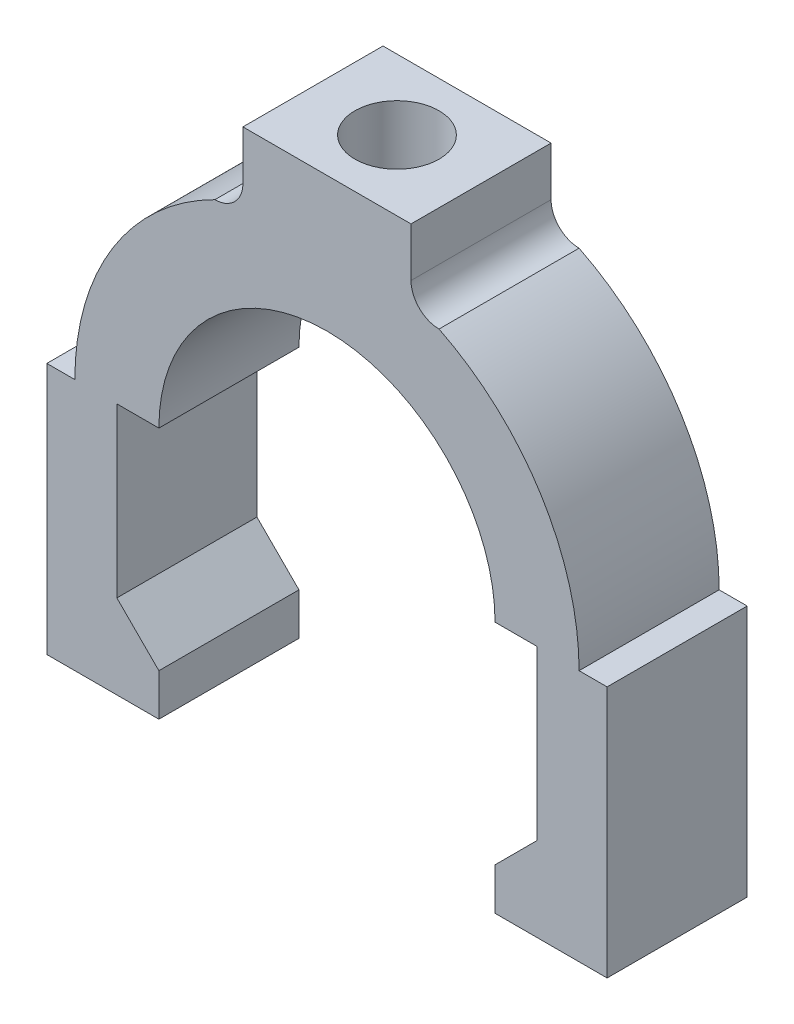
ISO-10303-21;
HEADER;
FILE_DESCRIPTION(('STEP AP214'),'2;1');
FILE_NAME('part.step','',(''),(''),'','','');
FILE_SCHEMA(('AUTOMOTIVE_DESIGN { 1 0 10303 214 1 1 1 1 }'));
ENDSEC;
DATA;
#1=APPLICATION_CONTEXT('core data for automotive mechanical design processes');
#2=APPLICATION_PROTOCOL_DEFINITION('international standard','automotive_design',2000,#1);
#3=PRODUCT_CONTEXT('',#1,'mechanical');
#4=PRODUCT('Part','Part','',(#3));
#5=PRODUCT_RELATED_PRODUCT_CATEGORY('part','',(#4));
#6=PRODUCT_DEFINITION_FORMATION('','',#4);
#7=PRODUCT_DEFINITION_CONTEXT('part definition',#1,'design');
#8=PRODUCT_DEFINITION('design','',#6,#7);
#9=PRODUCT_DEFINITION_SHAPE('','',#8);
#10=(LENGTH_UNIT() NAMED_UNIT(*) SI_UNIT(.MILLI.,.METRE.));
#11=(NAMED_UNIT(*) PLANE_ANGLE_UNIT() SI_UNIT($,.RADIAN.));
#12=(NAMED_UNIT(*) SI_UNIT($,.STERADIAN.) SOLID_ANGLE_UNIT());
#13=UNCERTAINTY_MEASURE_WITH_UNIT(LENGTH_MEASURE(1.E-05),#10,'distance_accuracy_value','');
#14=(GEOMETRIC_REPRESENTATION_CONTEXT(3) GLOBAL_UNCERTAINTY_ASSIGNED_CONTEXT((#13)) GLOBAL_UNIT_ASSIGNED_CONTEXT((#10,
#11,#12)) REPRESENTATION_CONTEXT('',''));
#15=CARTESIAN_POINT('',(0.,0.,0.));
#16=DIRECTION('',(0.,0.,1.));
#17=DIRECTION('',(1.,0.,0.));
#18=AXIS2_PLACEMENT_3D('',#15,#16,#17);
#19=CARTESIAN_POINT('',(12.,-43.2490309931942,20.));
#20=DIRECTION('',(0.,0.,-1.));
#21=DIRECTION('',(-1.,0.,0.));
#22=AXIS2_PLACEMENT_3D('',#19,#20,#21);
#23=CYLINDRICAL_SURFACE('',#22,24.);
#24=CARTESIAN_POINT('',(12.,-43.2490309931942,0.));
#25=DIRECTION('',(0.,0.,1.));
#26=DIRECTION('',(1.,0.,0.));
#27=AXIS2_PLACEMENT_3D('',#24,#25,#26);
#28=CIRCLE('',#27,24.);
#29=CARTESIAN_POINT('',(36.,-43.2490309931942,0.));
#30=VERTEX_POINT('',#29);
#31=CARTESIAN_POINT('',(-12.,-43.2490309931942,0.));
#32=VERTEX_POINT('',#31);
#33=EDGE_CURVE('E287',#30,#32,#28,.T.);
#34=ORIENTED_EDGE('',*,*,#33,.F.);
#35=DIRECTION('',(0.,0.,-1.));
#36=VECTOR('',#35,1.);
#37=CARTESIAN_POINT('',(36.,-43.2490309931942,20.));
#38=LINE('',#37,#36);
#39=CARTESIAN_POINT('',(36.,-43.2490309931942,20.));
#40=VERTEX_POINT('',#39);
#41=EDGE_CURVE('E356',#40,#30,#38,.T.);
#42=ORIENTED_EDGE('',*,*,#41,.F.);
#43=CARTESIAN_POINT('',(12.,-43.2490309931942,20.));
#44=DIRECTION('',(0.,0.,1.));
#45=DIRECTION('',(1.,0.,0.));
#46=AXIS2_PLACEMENT_3D('',#43,#44,#45);
#47=CIRCLE('',#46,24.);
#48=CARTESIAN_POINT('',(-12.,-43.2490309931942,20.));
#49=VERTEX_POINT('',#48);
#50=EDGE_CURVE('E526',#40,#49,#47,.T.);
#51=ORIENTED_EDGE('',*,*,#50,.T.);
#52=DIRECTION('',(0.,0.,-1.));
#53=VECTOR('',#52,1.);
#54=CARTESIAN_POINT('',(-12.,-43.2490309931942,20.));
#55=LINE('',#54,#53);
#56=EDGE_CURVE('E353',#49,#32,#55,.T.);
#57=ORIENTED_EDGE('',*,*,#56,.T.);
#58=EDGE_LOOP('',(#34,#42,#51,#57));
#59=FACE_BOUND('',#58,.T.);
#60=CARTESIAN_POINT('',(17.9567237536666,-20.,10.7193344997313));
#61=CARTESIAN_POINT('',(17.9366722157145,-19.9948750872522,10.8855477551348));
#62=CARTESIAN_POINT('',(17.9096326972914,-19.9879625135984,11.0508504700604));
#63=CARTESIAN_POINT('',(17.8419036192748,-19.9708537309565,11.378428070861));
#64=CARTESIAN_POINT('',(17.801216921579,-19.9606582104405,11.5407035840335));
#65=CARTESIAN_POINT('',(17.7065969108849,-19.9372941090037,11.860799145743));
#66=CARTESIAN_POINT('',(17.6526878403376,-19.9241309725638,12.0186267653695));
#67=CARTESIAN_POINT('',(17.5320213657373,-19.8952176640746,12.3290484726601));
#68=CARTESIAN_POINT('',(17.465263592785,-19.8794674177487,12.4816424099115));
#69=CARTESIAN_POINT('',(17.3194443736893,-19.8458453006553,12.780493476057));
#70=CARTESIAN_POINT('',(17.2403889468592,-19.8279744688572,12.9267536605854));
#71=CARTESIAN_POINT('',(17.0704935694356,-19.7906069131501,13.2121144548874));
#72=CARTESIAN_POINT('',(16.9796492648153,-19.7711095894783,13.3512123927593));
#73=CARTESIAN_POINT('',(16.786839515547,-19.7310409055465,13.6212833514732));
#74=CARTESIAN_POINT('',(16.6848753569715,-19.7104696696336,13.7522573091554));
#75=CARTESIAN_POINT('',(16.4704573315702,-19.668807491987,14.0053121147333));
#76=CARTESIAN_POINT('',(16.3579995469474,-19.6477163583294,14.127389610594));
#77=CARTESIAN_POINT('',(16.1211065232701,-19.6051896298134,14.3640631681794));
#78=CARTESIAN_POINT('',(15.9964832053519,-19.5837551701824,14.4784712688746));
#79=CARTESIAN_POINT('',(15.7379092618935,-19.541538550425,14.696449611805));
#80=CARTESIAN_POINT('',(15.6039551670349,-19.5207566371365,14.8000157866453));
#81=CARTESIAN_POINT('',(15.3276899741616,-19.4804391827157,14.9955084790985));
#82=CARTESIAN_POINT('',(15.1853814397207,-19.4609032630477,15.0874385402272));
#83=CARTESIAN_POINT('',(14.8932702157816,-19.4236102938033,15.2590581641824));
#84=CARTESIAN_POINT('',(14.7434648206088,-19.4058538935132,15.3387432648532));
#85=CARTESIAN_POINT('',(14.4374170908932,-19.3726265500895,15.4852330201922));
#86=CARTESIAN_POINT('',(14.281174079293,-19.3571558481361,15.5520363158363));
#87=CARTESIAN_POINT('',(13.9633667527338,-19.3289424353641,15.6722174734043));
#88=CARTESIAN_POINT('',(13.8018024787952,-19.3161997035219,15.7255954387936));
#89=CARTESIAN_POINT('',(13.4745549798837,-19.2938107268193,15.8184715137504));
#90=CARTESIAN_POINT('',(13.3088725685056,-19.2841638754825,15.8579723419632));
#91=CARTESIAN_POINT('',(12.9745898136563,-19.268243463698,15.9227661556549));
#92=CARTESIAN_POINT('',(12.8059894760555,-19.2619698964647,15.9480591697136));
#93=CARTESIAN_POINT('',(12.4716695887984,-19.2530991910502,15.9837306297597));
#94=CARTESIAN_POINT('',(12.3059928834466,-19.2504086009209,15.9944883041794));
#95=CARTESIAN_POINT('',(11.9742430095348,-19.2484714357093,16.0022390765058));
#96=CARTESIAN_POINT('',(11.8081697310235,-19.2492259635628,15.9992277663461));
#97=CARTESIAN_POINT('',(11.4769354104411,-19.254160012427,15.9794585281744));
#98=CARTESIAN_POINT('',(11.3117741608439,-19.2583387189828,15.9627038690731));
#99=CARTESIAN_POINT('',(10.9835207946194,-19.2700038528487,15.9155948605909));
#100=CARTESIAN_POINT('',(10.8204286921652,-19.2774903028034,15.8852404181065));
#101=CARTESIAN_POINT('',(10.4994258416553,-19.2954548451261,15.81163199394));
#102=CARTESIAN_POINT('',(10.3414763593196,-19.305895850904,15.7685376454492));
#103=CARTESIAN_POINT('',(10.0298643566259,-19.3295206611495,15.6696803889725));
#104=CARTESIAN_POINT('',(9.87620042098209,-19.3427035476601,15.6139217203138));
#105=CARTESIAN_POINT('',(9.57405947353882,-19.3714713531541,15.490125513837));
#106=CARTESIAN_POINT('',(9.42558469715659,-19.3870572920673,15.4220827601666));
#107=CARTESIAN_POINT('',(9.13489758089681,-19.4202126380649,15.2742552559381));
#108=CARTESIAN_POINT('',(8.99268319529718,-19.4377813904317,15.1944743786372));
#109=CARTESIAN_POINT('',(8.71255027578381,-19.4748214469002,15.0219792714636));
#110=CARTESIAN_POINT('',(8.57477688327061,-19.4943240536716,14.9290360169433));
#111=CARTESIAN_POINT('',(8.30755584726624,-19.5343919013956,14.7321653909352));
#112=CARTESIAN_POINT('',(8.17810541276141,-19.5549567819102,14.6282417328352));
#113=CARTESIAN_POINT('',(7.92822907465294,-19.59661594922,14.4100127881096));
#114=CARTESIAN_POINT('',(7.80780849351543,-19.6177105386147,14.2957014651223));
#115=CARTESIAN_POINT('',(7.57688789645956,-19.6598416696349,14.0575340583024));
#116=CARTESIAN_POINT('',(7.46638440990357,-19.6808782290511,13.9336813420472));
#117=CARTESIAN_POINT('',(7.25346159838048,-19.7228237067665,13.6741276318547));
#118=CARTESIAN_POINT('',(7.1512974237139,-19.7437176582567,13.5382147355156));
#119=CARTESIAN_POINT('',(6.95882715695373,-19.7842435810507,13.2581345927572));
#120=CARTESIAN_POINT('',(6.868516759266,-19.8038760092421,13.1139703709059));
#121=CARTESIAN_POINT('',(6.70040932303223,-19.8413024274724,12.818372921407));
#122=CARTESIAN_POINT('',(6.6226064956427,-19.8590972666255,12.6669430988598));
#123=CARTESIAN_POINT('',(6.48008816072602,-19.8923206022131,12.3578689611957));
#124=CARTESIAN_POINT('',(6.41536926293459,-19.9077497113966,12.2002262686205));
#125=CARTESIAN_POINT('',(6.28044770478669,-19.9403834778416,11.8269998049434));
#126=CARTESIAN_POINT('',(6.21543480909445,-19.9565047830136,11.6094028639243));
#127=CARTESIAN_POINT('',(6.13669844539461,-19.9762484898549,11.2785043129763));
#128=CARTESIAN_POINT('',(6.11358612714192,-19.9820893202612,11.1674760542472));
#129=CARTESIAN_POINT('',(6.07367825610507,-19.9922230617034,10.9442240308355));
#130=CARTESIAN_POINT('',(6.05688249939753,-19.9965160227104,10.8320003048677));
#131=CARTESIAN_POINT('',(6.04327624633337,-20.,10.7193344997313));
#132=B_SPLINE_CURVE_WITH_KNOTS('',3,(#60,#61,#62,#63,#64,#65,#66,#67,#68,#69,#70,#71,#72,#73,
#74,#75,#76,#77,#78,#79,#80,#81,#82,#83,#84,#85,#86,#87,#88,#89,#90,#91,#92,#93,#94,#95,#96,#97,
#98,#99,#100,#101,#102,#103,#104,#105,#106,#107,#108,#109,#110,#111,#112,#113,#114,#115,#116,
#117,#118,#119,#120,#121,#122,#123,#124,#125,#126,#127,#128,#129,#130,#131),.UNSPECIFIED.,.F.,
.F.,(4,2,2,2,2,2,2,2,2,2,2,2,2,2,2,2,2,2,2,2,2,2,2,2,2,2,2,2,2,2,2,2,2,2,2,4),(0.,
0.502316897238534,1.00452852131734,1.50582616371642,2.00713820103227,2.50820562957609,
3.00945864858852,3.5106537562766,4.01203673969841,4.52301803145163,5.0341903381887,
5.54520660248876,6.05640864559896,6.56766459080687,7.07891659578509,7.59006838637142,
8.10121914874435,8.59875833552551,9.09645681795312,9.59403695511616,10.0916204987423,
10.5832159652996,11.0746471142752,11.5662874189768,12.0577658582569,12.559188601844,
13.0604423121863,13.5619891911827,14.0633598561406,14.5766689157384,15.089791009372,
15.6026749281427,16.1154257793233,16.7967151912876,17.1372289721767,17.4777317590017),.UNSPECIFIED.);
#133=CARTESIAN_POINT('',(17.9567237536666,-20.,10.7193344997313));
#134=VERTEX_POINT('',#133);
#135=CARTESIAN_POINT('',(6.04327624633337,-20.,10.7193344997313));
#136=VERTEX_POINT('',#135);
#137=EDGE_CURVE('E391',#134,#136,#132,.T.);
#138=ORIENTED_EDGE('',*,*,#137,.F.);
#139=DIRECTION('',(0.,0.,-1.));
#140=VECTOR('',#139,1.);
#141=CARTESIAN_POINT('',(17.9567237536666,-20.,20.));
#142=LINE('',#141,#140);
#143=CARTESIAN_POINT('',(17.9567237536666,-20.,9.28066550026872));
#144=VERTEX_POINT('',#143);
#145=EDGE_CURVE('E11',#134,#144,#142,.T.);
#146=ORIENTED_EDGE('',*,*,#145,.T.);
#147=CARTESIAN_POINT('',(6.04327624633337,-20.,9.28066550026867));
#148=CARTESIAN_POINT('',(6.06332778428551,-19.9948750872522,9.11445224486512));
#149=CARTESIAN_POINT('',(6.0903673027086,-19.9879625135984,8.94914952993954));
#150=CARTESIAN_POINT('',(6.15809638072517,-19.9708537309565,8.62157192913892));
#151=CARTESIAN_POINT('',(6.19878307842105,-19.9606582104405,8.45929641596642));
#152=CARTESIAN_POINT('',(6.29340308911513,-19.9372941090037,8.13920085425699));
#153=CARTESIAN_POINT('',(6.34731215966243,-19.9241309725638,7.98137323463041));
#154=CARTESIAN_POINT('',(6.46797863426269,-19.8952176640746,7.67095152733982));
#155=CARTESIAN_POINT('',(6.53473640721506,-19.8794674177487,7.51835759008845));
#156=CARTESIAN_POINT('',(6.68055562631074,-19.8458453006553,7.21950652394298));
#157=CARTESIAN_POINT('',(6.75961105314081,-19.8279744688572,7.07324633941457));
#158=CARTESIAN_POINT('',(6.92950643056445,-19.7906069131501,6.78788554511257));
#159=CARTESIAN_POINT('',(7.02035073518468,-19.7711095894783,6.64878760724061));
#160=CARTESIAN_POINT('',(7.21316048445302,-19.7310409055465,6.37871664852677));
#161=CARTESIAN_POINT('',(7.31512464302855,-19.7104696696336,6.24774269084454));
#162=CARTESIAN_POINT('',(7.52954266842985,-19.668807491987,5.99468788526667));
#163=CARTESIAN_POINT('',(7.6420004530526,-19.6477163583294,5.872610389406));
#164=CARTESIAN_POINT('',(7.87889347672999,-19.6051896298134,5.63593683182054));
#165=CARTESIAN_POINT('',(8.00351679464813,-19.5837551701824,5.52152873112537));
#166=CARTESIAN_POINT('',(8.26209073810653,-19.541538550425,5.30355038819499));
#167=CARTESIAN_POINT('',(8.39604483296512,-19.5207566371365,5.19998421335466));
#168=CARTESIAN_POINT('',(8.67231002583845,-19.4804391827157,5.00449152090148));
#169=CARTESIAN_POINT('',(8.81461856027939,-19.4609032630477,4.91256145977273));
#170=CARTESIAN_POINT('',(9.10672978421845,-19.4236102938033,4.74094183581757));
#171=CARTESIAN_POINT('',(9.25653517939124,-19.4058538935132,4.66125673514682));
#172=CARTESIAN_POINT('',(9.56258290910685,-19.3726265500894,4.51476697980774));
#173=CARTESIAN_POINT('',(9.71882592070704,-19.3571558481361,4.44796368416363));
#174=CARTESIAN_POINT('',(10.0366332472662,-19.3289424353641,4.32778252659563));
#175=CARTESIAN_POINT('',(10.1981975212048,-19.3161997035219,4.27440456120642));
#176=CARTESIAN_POINT('',(10.5254450201163,-19.2938107268193,4.18152848624957));
#177=CARTESIAN_POINT('',(10.6911274314945,-19.2841638754825,4.14202765803681));
#178=CARTESIAN_POINT('',(11.0254101863437,-19.2682434636979,4.07723384434513));
#179=CARTESIAN_POINT('',(11.1940105239445,-19.2619698964647,4.05194083028643));
#180=CARTESIAN_POINT('',(11.5283304112017,-19.2530991910502,4.01626937024032));
#181=CARTESIAN_POINT('',(11.6940071165535,-19.2504086009209,4.00551169582057));
#182=CARTESIAN_POINT('',(12.0257569904652,-19.2484714357093,3.99776092349416));
#183=CARTESIAN_POINT('',(12.1918302689766,-19.2492259635628,4.00077223365388));
#184=CARTESIAN_POINT('',(12.523064589559,-19.254160012427,4.0205414718256));
#185=CARTESIAN_POINT('',(12.6882258391561,-19.2583387189828,4.03729613092695));
#186=CARTESIAN_POINT('',(13.0164792053806,-19.2700038528487,4.08440513940916));
#187=CARTESIAN_POINT('',(13.1795713078349,-19.2774903028034,4.11475958189351));
#188=CARTESIAN_POINT('',(13.5005741583448,-19.2954548451261,4.18836800606001));
#189=CARTESIAN_POINT('',(13.6585236406804,-19.305895850904,4.23146235455086));
#190=CARTESIAN_POINT('',(13.9701356433741,-19.3295206611495,4.3303196110275));
#191=CARTESIAN_POINT('',(14.123799579018,-19.3427035476601,4.38607827968622));
#192=CARTESIAN_POINT('',(14.4259405264612,-19.3714713531541,4.50987448616306));
#193=CARTESIAN_POINT('',(14.5744153028435,-19.3870572920673,4.57791723983345));
#194=CARTESIAN_POINT('',(14.8651024191032,-19.4202126380649,4.72574474406196));
#195=CARTESIAN_POINT('',(15.0073168047029,-19.4377813904317,4.80552562136278));
#196=CARTESIAN_POINT('',(15.2874497242162,-19.4748214469002,4.9780207285364));
#197=CARTESIAN_POINT('',(15.4252231167294,-19.4943240536716,5.07096398305669));
#198=CARTESIAN_POINT('',(15.6924441527338,-19.5343919013956,5.26783460906478));
#199=CARTESIAN_POINT('',(15.8218945872386,-19.5549567819102,5.37175826716487));
#200=CARTESIAN_POINT('',(16.0717709253471,-19.59661594922,5.58998721189049));
#201=CARTESIAN_POINT('',(16.1921915064846,-19.6177105386147,5.70429853487773));
#202=CARTESIAN_POINT('',(16.4231121035405,-19.6598416696349,5.94246594169769));
#203=CARTESIAN_POINT('',(16.5336155900965,-19.6808782290511,6.06631865795285));
#204=CARTESIAN_POINT('',(16.7465384016196,-19.7228237067665,6.32587236814534));
#205=CARTESIAN_POINT('',(16.8487025762861,-19.7437176582567,6.46178526448442));
#206=CARTESIAN_POINT('',(17.0411728430463,-19.7842435810507,6.74186540724286));
#207=CARTESIAN_POINT('',(17.131483240734,-19.8038760092421,6.88602962909418));
#208=CARTESIAN_POINT('',(17.2995906769678,-19.8413024274724,7.18162707859308));
#209=CARTESIAN_POINT('',(17.3773935043573,-19.8590972666255,7.33305690114021));
#210=CARTESIAN_POINT('',(17.519911839274,-19.8923206022131,7.64213103880432));
#211=CARTESIAN_POINT('',(17.5846307370654,-19.9077497113966,7.79977373137956));
#212=CARTESIAN_POINT('',(17.7195522952133,-19.9403834778416,8.17300019505667));
#213=CARTESIAN_POINT('',(17.7845651909056,-19.9565047830136,8.39059713607577));
#214=CARTESIAN_POINT('',(17.8633015546054,-19.9762484898549,8.72149568702378));
#215=CARTESIAN_POINT('',(17.8864138728581,-19.9820893202612,8.83252394575288));
#216=CARTESIAN_POINT('',(17.9263217438949,-19.9922230617034,9.05577596916452));
#217=CARTESIAN_POINT('',(17.9431175006025,-19.9965160227104,9.16799969513238));
#218=CARTESIAN_POINT('',(17.9567237536666,-20.,9.28066550026872));
#219=B_SPLINE_CURVE_WITH_KNOTS('',3,(#147,#148,#149,#150,#151,#152,#153,#154,#155,#156,#157,
#158,#159,#160,#161,#162,#163,#164,#165,#166,#167,#168,#169,#170,#171,#172,#173,#174,#175,#176,
#177,#178,#179,#180,#181,#182,#183,#184,#185,#186,#187,#188,#189,#190,#191,#192,#193,#194,#195,
#196,#197,#198,#199,#200,#201,#202,#203,#204,#205,#206,#207,#208,#209,#210,#211,#212,#213,#214,
#215,#216,#217,#218),.UNSPECIFIED.,.F.,.F.,(4,2,2,2,2,2,2,2,2,2,2,2,2,2,2,2,2,2,2,2,2,2,2,2,2,2,
2,2,2,2,2,2,2,2,2,4),(0.,0.502316897238533,1.00452852131734,1.50582616371642,2.00713820103227,
2.5082056295761,3.00945864858852,3.51065375627661,4.01203673969841,4.52301803145164,
5.03419033818871,5.54520660248877,6.05640864559897,6.56766459080688,7.0789165957851,
7.59006838637143,8.10121914874436,8.59875833552551,9.09645681795313,9.59403695511617,
10.0916204987423,10.5832159652996,11.0746471142752,11.5662874189768,12.0577658582569,
12.559188601844,13.0604423121863,13.5619891911827,14.0633598561406,14.5766689157384,
15.089791009372,15.6026749281427,16.1154257793233,16.7967151912876,17.1372289721767,
17.4777317590017),.UNSPECIFIED.);
#220=CARTESIAN_POINT('',(6.04327624633337,-20.,9.28066550026867));
#221=VERTEX_POINT('',#220);
#222=EDGE_CURVE('E52',#221,#144,#219,.T.);
#223=ORIENTED_EDGE('',*,*,#222,.F.);
#224=DIRECTION('',(0.,0.,-1.));
#225=VECTOR('',#224,1.);
#226=CARTESIAN_POINT('',(6.04327624633337,-20.,20.));
#227=LINE('',#226,#225);
#228=EDGE_CURVE('E327',#221,#136,#227,.F.);
#229=ORIENTED_EDGE('',*,*,#228,.T.);
#230=EDGE_LOOP('',(#138,#146,#223,#229));
#231=FACE_BOUND('',#230,.T.);
#232=ADVANCED_FACE('F43',(#59,#231),#23,.F.);
#233=CARTESIAN_POINT('',(0.,0.,20.));
#234=DIRECTION('',(0.,1.,0.));
#235=DIRECTION('',(0.,0.,1.));
#236=AXIS2_PLACEMENT_3D('',#233,#234,#235);
#237=PLANE('',#236);
#238=CARTESIAN_POINT('',(12.,0.,10.));
#239=DIRECTION('',(0.,1.,0.));
#240=DIRECTION('',(0.,0.,1.));
#241=AXIS2_PLACEMENT_3D('',#238,#239,#240);
#242=CIRCLE('',#241,6.);
#243=CARTESIAN_POINT('',(12.,0.,16.));
#244=VERTEX_POINT('',#243);
#245=EDGE_CURVE('E483',#244,#244,#242,.T.);
#246=ORIENTED_EDGE('',*,*,#245,.F.);
#247=EDGE_LOOP('',(#246));
#248=FACE_BOUND('',#247,.T.);
#249=DIRECTION('',(1.,0.,0.));
#250=VECTOR('',#249,1.);
#251=CARTESIAN_POINT('',(0.,0.,0.));
#252=LINE('',#251,#250);
#253=CARTESIAN_POINT('',(0.,0.,0.));
#254=VERTEX_POINT('',#253);
#255=CARTESIAN_POINT('',(24.,0.,0.));
#256=VERTEX_POINT('',#255);
#257=EDGE_CURVE('E242',#254,#256,#252,.T.);
#258=ORIENTED_EDGE('',*,*,#257,.F.);
#259=DIRECTION('',(0.,0.,-1.));
#260=VECTOR('',#259,1.);
#261=CARTESIAN_POINT('',(0.,0.,20.));
#262=LINE('',#261,#260);
#263=CARTESIAN_POINT('',(0.,0.,20.));
#264=VERTEX_POINT('',#263);
#265=EDGE_CURVE('E67',#264,#254,#262,.T.);
#266=ORIENTED_EDGE('',*,*,#265,.F.);
#267=DIRECTION('',(1.,0.,0.));
#268=VECTOR('',#267,1.);
#269=CARTESIAN_POINT('',(0.,0.,20.));
#270=LINE('',#269,#268);
#271=CARTESIAN_POINT('',(24.,0.,20.));
#272=VERTEX_POINT('',#271);
#273=EDGE_CURVE('E324',#264,#272,#270,.T.);
#274=ORIENTED_EDGE('',*,*,#273,.T.);
#275=DIRECTION('',(0.,0.,-1.));
#276=VECTOR('',#275,1.);
#277=CARTESIAN_POINT('',(24.,0.,20.));
#278=LINE('',#277,#276);
#279=EDGE_CURVE('E148',#272,#256,#278,.T.);
#280=ORIENTED_EDGE('',*,*,#279,.T.);
#281=EDGE_LOOP('',(#258,#266,#274,#280));
#282=FACE_BOUND('',#281,.T.);
#283=ADVANCED_FACE('F45',(#248,#282),#237,.T.);
#284=CARTESIAN_POINT('',(0.,0.,20.));
#285=DIRECTION('',(1.,0.,0.));
#286=DIRECTION('',(0.,0.,-1.));
#287=AXIS2_PLACEMENT_3D('',#284,#285,#286);
#288=PLANE('',#287);
#289=DIRECTION('',(0.,-1.,0.));
#290=VECTOR('',#289,1.);
#291=CARTESIAN_POINT('',(0.,0.,0.));
#292=LINE('',#291,#290);
#293=CARTESIAN_POINT('',(0.,-7.,0.));
#294=VERTEX_POINT('',#293);
#295=EDGE_CURVE('E321',#254,#294,#292,.T.);
#296=ORIENTED_EDGE('',*,*,#295,.T.);
#297=DIRECTION('',(0.,0.,-1.));
#298=VECTOR('',#297,1.);
#299=CARTESIAN_POINT('',(0.,-7.,20.));
#300=LINE('',#299,#298);
#301=CARTESIAN_POINT('',(0.,-7.,20.));
#302=VERTEX_POINT('',#301);
#303=EDGE_CURVE('E220',#302,#294,#300,.T.);
#304=ORIENTED_EDGE('',*,*,#303,.F.);
#305=DIRECTION('',(0.,-1.,0.));
#306=VECTOR('',#305,1.);
#307=CARTESIAN_POINT('',(0.,0.,20.));
#308=LINE('',#307,#306);
#309=EDGE_CURVE('E234',#264,#302,#308,.T.);
#310=ORIENTED_EDGE('',*,*,#309,.F.);
#311=ORIENTED_EDGE('',*,*,#265,.T.);
#312=EDGE_LOOP('',(#296,#304,#310,#311));
#313=FACE_BOUND('',#312,.T.);
#314=ADVANCED_FACE('F422',(#313),#288,.F.);
#315=CARTESIAN_POINT('',(-4.,-7.,20.));
#316=DIRECTION('',(0.,0.,-1.));
#317=DIRECTION('',(-1.,0.,0.));
#318=AXIS2_PLACEMENT_3D('',#315,#316,#317);
#319=CYLINDRICAL_SURFACE('',#318,4.);
#320=CARTESIAN_POINT('',(-4.,-7.,0.));
#321=DIRECTION('',(0.,0.,1.));
#322=DIRECTION('',(1.,0.,0.));
#323=AXIS2_PLACEMENT_3D('',#320,#321,#322);
#324=CIRCLE('',#323,4.);
#325=CARTESIAN_POINT('',(-4.00000000000001,-11.,0.));
#326=VERTEX_POINT('',#325);
#327=EDGE_CURVE('E215',#326,#294,#324,.T.);
#328=ORIENTED_EDGE('',*,*,#327,.F.);
#329=DIRECTION('',(0.,0.,-1.));
#330=VECTOR('',#329,1.);
#331=CARTESIAN_POINT('',(-4.00000000000001,-11.,20.));
#332=LINE('',#331,#330);
#333=CARTESIAN_POINT('',(-4.00000000000001,-11.,20.));
#334=VERTEX_POINT('',#333);
#335=EDGE_CURVE('E209',#334,#326,#332,.T.);
#336=ORIENTED_EDGE('',*,*,#335,.F.);
#337=CARTESIAN_POINT('',(-4.,-7.,20.));
#338=DIRECTION('',(0.,0.,1.));
#339=DIRECTION('',(1.,0.,0.));
#340=AXIS2_PLACEMENT_3D('',#337,#338,#339);
#341=CIRCLE('',#340,4.);
#342=EDGE_CURVE('E213',#334,#302,#341,.T.);
#343=ORIENTED_EDGE('',*,*,#342,.T.);
#344=ORIENTED_EDGE('',*,*,#303,.T.);
#345=EDGE_LOOP('',(#328,#336,#343,#344));
#346=FACE_BOUND('',#345,.T.);
#347=ADVANCED_FACE('F211',(#346),#319,.F.);
#348=CARTESIAN_POINT('',(12.,-43.2490309931942,20.));
#349=DIRECTION('',(0.,0.,-1.));
#350=DIRECTION('',(-1.,0.,0.));
#351=AXIS2_PLACEMENT_3D('',#348,#349,#350);
#352=CYLINDRICAL_SURFACE('',#351,36.);
#353=CARTESIAN_POINT('',(12.,-43.2490309931942,0.));
#354=DIRECTION('',(0.,0.,1.));
#355=DIRECTION('',(1.,0.,0.));
#356=AXIS2_PLACEMENT_3D('',#353,#354,#355);
#357=CIRCLE('',#356,36.);
#358=CARTESIAN_POINT('',(-24.,-43.2490309931942,0.));
#359=VERTEX_POINT('',#358);
#360=EDGE_CURVE('E316',#326,#359,#357,.T.);
#361=ORIENTED_EDGE('',*,*,#360,.T.);
#362=DIRECTION('',(0.,0.,-1.));
#363=VECTOR('',#362,1.);
#364=CARTESIAN_POINT('',(-24.,-43.2490309931942,20.));
#365=LINE('',#364,#363);
#366=CARTESIAN_POINT('',(-24.,-43.2490309931942,20.));
#367=VERTEX_POINT('',#366);
#368=EDGE_CURVE('E221',#367,#359,#365,.T.);
#369=ORIENTED_EDGE('',*,*,#368,.F.);
#370=CARTESIAN_POINT('',(12.,-43.2490309931942,20.));
#371=DIRECTION('',(0.,0.,1.));
#372=DIRECTION('',(1.,0.,0.));
#373=AXIS2_PLACEMENT_3D('',#370,#371,#372);
#374=CIRCLE('',#373,36.);
#375=EDGE_CURVE('E224',#334,#367,#374,.T.);
#376=ORIENTED_EDGE('',*,*,#375,.F.);
#377=ORIENTED_EDGE('',*,*,#335,.T.);
#378=EDGE_LOOP('',(#361,#369,#376,#377));
#379=FACE_BOUND('',#378,.T.);
#380=ADVANCED_FACE('F225',(#379),#352,.T.);
#381=CARTESIAN_POINT('',(-28.,-43.2490309931942,20.));
#382=DIRECTION('',(0.,1.,0.));
#383=DIRECTION('',(0.,0.,1.));
#384=AXIS2_PLACEMENT_3D('',#381,#382,#383);
#385=PLANE('',#384);
#386=DIRECTION('',(1.,0.,0.));
#387=VECTOR('',#386,1.);
#388=CARTESIAN_POINT('',(-28.,-43.2490309931942,0.));
#389=LINE('',#388,#387);
#390=CARTESIAN_POINT('',(-28.,-43.2490309931942,0.));
#391=VERTEX_POINT('',#390);
#392=EDGE_CURVE('E312',#391,#359,#389,.T.);
#393=ORIENTED_EDGE('',*,*,#392,.F.);
#394=DIRECTION('',(0.,0.,-1.));
#395=VECTOR('',#394,1.);
#396=CARTESIAN_POINT('',(-28.,-43.2490309931942,20.));
#397=LINE('',#396,#395);
#398=CARTESIAN_POINT('',(-28.,-43.2490309931942,20.));
#399=VERTEX_POINT('',#398);
#400=EDGE_CURVE('E332',#399,#391,#397,.T.);
#401=ORIENTED_EDGE('',*,*,#400,.F.);
#402=DIRECTION('',(1.,0.,0.));
#403=VECTOR('',#402,1.);
#404=CARTESIAN_POINT('',(-28.,-43.2490309931942,20.));
#405=LINE('',#404,#403);
#406=EDGE_CURVE('E230',#399,#367,#405,.T.);
#407=ORIENTED_EDGE('',*,*,#406,.T.);
#408=ORIENTED_EDGE('',*,*,#368,.T.);
#409=EDGE_LOOP('',(#393,#401,#407,#408));
#410=FACE_BOUND('',#409,.T.);
#411=ADVANCED_FACE('F429',(#410),#385,.T.);
#412=CARTESIAN_POINT('',(-28.,-43.2490309931942,20.));
#413=DIRECTION('',(1.,0.,0.));
#414=DIRECTION('',(0.,0.,-1.));
#415=AXIS2_PLACEMENT_3D('',#412,#413,#414);
#416=PLANE('',#415);
#417=DIRECTION('',(0.,-1.,0.));
#418=VECTOR('',#417,1.);
#419=CARTESIAN_POINT('',(-28.,-43.2490309931942,0.));
#420=LINE('',#419,#418);
#421=CARTESIAN_POINT('',(-28.,-79.2490309931942,0.));
#422=VERTEX_POINT('',#421);
#423=EDGE_CURVE('E309',#391,#422,#420,.T.);
#424=ORIENTED_EDGE('',*,*,#423,.T.);
#425=DIRECTION('',(0.,0.,-1.));
#426=VECTOR('',#425,1.);
#427=CARTESIAN_POINT('',(-28.,-79.2490309931942,20.));
#428=LINE('',#427,#426);
#429=CARTESIAN_POINT('',(-28.,-79.2490309931942,20.));
#430=VERTEX_POINT('',#429);
#431=EDGE_CURVE('E335',#430,#422,#428,.T.);
#432=ORIENTED_EDGE('',*,*,#431,.F.);
#433=DIRECTION('',(0.,-1.,0.));
#434=VECTOR('',#433,1.);
#435=CARTESIAN_POINT('',(-28.,-43.2490309931942,20.));
#436=LINE('',#435,#434);
#437=EDGE_CURVE('E546',#399,#430,#436,.T.);
#438=ORIENTED_EDGE('',*,*,#437,.F.);
#439=ORIENTED_EDGE('',*,*,#400,.T.);
#440=EDGE_LOOP('',(#424,#432,#438,#439));
#441=FACE_BOUND('',#440,.T.);
#442=ADVANCED_FACE('F432',(#441),#416,.F.);
#443=CARTESIAN_POINT('',(-28.,-79.2490309931942,20.));
#444=DIRECTION('',(0.,1.,0.));
#445=DIRECTION('',(0.,0.,1.));
#446=AXIS2_PLACEMENT_3D('',#443,#444,#445);
#447=PLANE('',#446);
#448=DIRECTION('',(1.,0.,0.));
#449=VECTOR('',#448,1.);
#450=CARTESIAN_POINT('',(-28.,-79.2490309931942,0.));
#451=LINE('',#450,#449);
#452=CARTESIAN_POINT('',(-12.,-79.2490309931942,0.));
#453=VERTEX_POINT('',#452);
#454=EDGE_CURVE('E306',#422,#453,#451,.T.);
#455=ORIENTED_EDGE('',*,*,#454,.T.);
#456=DIRECTION('',(0.,0.,-1.));
#457=VECTOR('',#456,1.);
#458=CARTESIAN_POINT('',(-12.,-79.2490309931942,20.));
#459=LINE('',#458,#457);
#460=CARTESIAN_POINT('',(-12.,-79.2490309931942,20.));
#461=VERTEX_POINT('',#460);
#462=EDGE_CURVE('E339',#461,#453,#459,.T.);
#463=ORIENTED_EDGE('',*,*,#462,.F.);
#464=DIRECTION('',(1.,0.,0.));
#465=VECTOR('',#464,1.);
#466=CARTESIAN_POINT('',(-28.,-79.2490309931942,20.));
#467=LINE('',#466,#465);
#468=EDGE_CURVE('E543',#430,#461,#467,.T.);
#469=ORIENTED_EDGE('',*,*,#468,.F.);
#470=ORIENTED_EDGE('',*,*,#431,.T.);
#471=EDGE_LOOP('',(#455,#463,#469,#470));
#472=FACE_BOUND('',#471,.T.);
#473=ADVANCED_FACE('F436',(#472),#447,.F.);
#474=CARTESIAN_POINT('',(-12.,-79.2490309931942,20.));
#475=DIRECTION('',(-1.,0.,0.));
#476=DIRECTION('',(0.,0.,1.));
#477=AXIS2_PLACEMENT_3D('',#474,#475,#476);
#478=PLANE('',#477);
#479=DIRECTION('',(0.,1.,0.));
#480=VECTOR('',#479,1.);
#481=CARTESIAN_POINT('',(-12.,-79.2490309931942,0.));
#482=LINE('',#481,#480);
#483=CARTESIAN_POINT('',(-12.,-73.2490309931942,0.));
#484=VERTEX_POINT('',#483);
#485=EDGE_CURVE('E303',#453,#484,#482,.T.);
#486=ORIENTED_EDGE('',*,*,#485,.T.);
#487=DIRECTION('',(0.,0.,-1.));
#488=VECTOR('',#487,1.);
#489=CARTESIAN_POINT('',(-12.,-73.2490309931942,20.));
#490=LINE('',#489,#488);
#491=CARTESIAN_POINT('',(-12.,-73.2490309931942,20.));
#492=VERTEX_POINT('',#491);
#493=EDGE_CURVE('E343',#492,#484,#490,.T.);
#494=ORIENTED_EDGE('',*,*,#493,.F.);
#495=DIRECTION('',(0.,1.,0.));
#496=VECTOR('',#495,1.);
#497=CARTESIAN_POINT('',(-12.,-79.2490309931942,20.));
#498=LINE('',#497,#496);
#499=EDGE_CURVE('E540',#461,#492,#498,.T.);
#500=ORIENTED_EDGE('',*,*,#499,.F.);
#501=ORIENTED_EDGE('',*,*,#462,.T.);
#502=EDGE_LOOP('',(#486,#494,#500,#501));
#503=FACE_BOUND('',#502,.T.);
#504=ADVANCED_FACE('F440',(#503),#478,.F.);
#505=CARTESIAN_POINT('',(-12.,-73.2490309931942,20.));
#506=DIRECTION('',(-0.707106781186552,-0.707106781186543,0.));
#507=DIRECTION('',(0.707106781186543,-0.707106781186552,0.));
#508=AXIS2_PLACEMENT_3D('',#505,#506,#507);
#509=PLANE('',#508);
#510=DIRECTION('',(-0.707106781186543,0.707106781186552,0.));
#511=VECTOR('',#510,1.);
#512=CARTESIAN_POINT('',(-12.,-73.2490309931942,0.));
#513=LINE('',#512,#511);
#514=CARTESIAN_POINT('',(-18.,-67.2490309931941,0.));
#515=VERTEX_POINT('',#514);
#516=EDGE_CURVE('E299',#484,#515,#513,.T.);
#517=ORIENTED_EDGE('',*,*,#516,.T.);
#518=DIRECTION('',(0.,0.,-1.));
#519=VECTOR('',#518,1.);
#520=CARTESIAN_POINT('',(-18.,-67.2490309931941,20.));
#521=LINE('',#520,#519);
#522=CARTESIAN_POINT('',(-18.,-67.2490309931941,20.));
#523=VERTEX_POINT('',#522);
#524=EDGE_CURVE('E347',#523,#515,#521,.T.);
#525=ORIENTED_EDGE('',*,*,#524,.F.);
#526=DIRECTION('',(-0.707106781186543,0.707106781186552,0.));
#527=VECTOR('',#526,1.);
#528=CARTESIAN_POINT('',(-12.,-73.2490309931942,20.));
#529=LINE('',#528,#527);
#530=EDGE_CURVE('E537',#492,#523,#529,.T.);
#531=ORIENTED_EDGE('',*,*,#530,.F.);
#532=ORIENTED_EDGE('',*,*,#493,.T.);
#533=EDGE_LOOP('',(#517,#525,#531,#532));
#534=FACE_BOUND('',#533,.T.);
#535=ADVANCED_FACE('F444',(#534),#509,.F.);
#536=CARTESIAN_POINT('',(-18.,-43.2490309931942,20.));
#537=DIRECTION('',(1.,0.,0.));
#538=DIRECTION('',(0.,0.,-1.));
#539=AXIS2_PLACEMENT_3D('',#536,#537,#538);
#540=PLANE('',#539);
#541=DIRECTION('',(0.,-1.,0.));
#542=VECTOR('',#541,1.);
#543=CARTESIAN_POINT('',(-18.,-43.2490309931942,0.));
#544=LINE('',#543,#542);
#545=CARTESIAN_POINT('',(-18.,-43.2490309931942,0.));
#546=VERTEX_POINT('',#545);
#547=EDGE_CURVE('E295',#546,#515,#544,.T.);
#548=ORIENTED_EDGE('',*,*,#547,.F.);
#549=DIRECTION('',(0.,0.,-1.));
#550=VECTOR('',#549,1.);
#551=CARTESIAN_POINT('',(-18.,-43.2490309931942,20.));
#552=LINE('',#551,#550);
#553=CARTESIAN_POINT('',(-18.,-43.2490309931942,20.));
#554=VERTEX_POINT('',#553);
#555=EDGE_CURVE('E350',#554,#546,#552,.T.);
#556=ORIENTED_EDGE('',*,*,#555,.F.);
#557=DIRECTION('',(0.,-1.,0.));
#558=VECTOR('',#557,1.);
#559=CARTESIAN_POINT('',(-18.,-43.2490309931942,20.));
#560=LINE('',#559,#558);
#561=EDGE_CURVE('E533',#554,#523,#560,.T.);
#562=ORIENTED_EDGE('',*,*,#561,.T.);
#563=ORIENTED_EDGE('',*,*,#524,.T.);
#564=EDGE_LOOP('',(#548,#556,#562,#563));
#565=FACE_BOUND('',#564,.T.);
#566=ADVANCED_FACE('F448',(#565),#540,.T.);
#567=CARTESIAN_POINT('',(-18.,-43.2490309931942,20.));
#568=DIRECTION('',(0.,1.,0.));
#569=DIRECTION('',(0.,0.,1.));
#570=AXIS2_PLACEMENT_3D('',#567,#568,#569);
#571=PLANE('',#570);
#572=DIRECTION('',(1.,0.,0.));
#573=VECTOR('',#572,1.);
#574=CARTESIAN_POINT('',(-18.,-43.2490309931942,0.));
#575=LINE('',#574,#573);
#576=EDGE_CURVE('E291',#546,#32,#575,.T.);
#577=ORIENTED_EDGE('',*,*,#576,.T.);
#578=ORIENTED_EDGE('',*,*,#56,.F.);
#579=DIRECTION('',(1.,0.,0.));
#580=VECTOR('',#579,1.);
#581=CARTESIAN_POINT('',(-18.,-43.2490309931942,20.));
#582=LINE('',#581,#580);
#583=EDGE_CURVE('E530',#554,#49,#582,.T.);
#584=ORIENTED_EDGE('',*,*,#583,.F.);
#585=ORIENTED_EDGE('',*,*,#555,.T.);
#586=EDGE_LOOP('',(#577,#578,#584,#585));
#587=FACE_BOUND('',#586,.T.);
#588=ADVANCED_FACE('F451',(#587),#571,.F.);
#589=CARTESIAN_POINT('',(42.,-43.2490309931942,20.));
#590=DIRECTION('',(0.,-1.,0.));
#591=DIRECTION('',(0.,0.,-1.));
#592=AXIS2_PLACEMENT_3D('',#589,#590,#591);
#593=PLANE('',#592);
#594=DIRECTION('',(-1.,0.,0.));
#595=VECTOR('',#594,1.);
#596=CARTESIAN_POINT('',(42.,-43.2490309931942,0.));
#597=LINE('',#596,#595);
#598=CARTESIAN_POINT('',(42.,-43.2490309931942,0.));
#599=VERTEX_POINT('',#598);
#600=EDGE_CURVE('E283',#599,#30,#597,.T.);
#601=ORIENTED_EDGE('',*,*,#600,.F.);
#602=DIRECTION('',(0.,0.,-1.));
#603=VECTOR('',#602,1.);
#604=CARTESIAN_POINT('',(42.,-43.2490309931942,20.));
#605=LINE('',#604,#603);
#606=CARTESIAN_POINT('',(42.,-43.2490309931942,20.));
#607=VERTEX_POINT('',#606);
#608=EDGE_CURVE('E359',#607,#599,#605,.T.);
#609=ORIENTED_EDGE('',*,*,#608,.F.);
#610=DIRECTION('',(-1.,0.,0.));
#611=VECTOR('',#610,1.);
#612=CARTESIAN_POINT('',(42.,-43.2490309931942,20.));
#613=LINE('',#612,#611);
#614=EDGE_CURVE('E522',#607,#40,#613,.T.);
#615=ORIENTED_EDGE('',*,*,#614,.T.);
#616=ORIENTED_EDGE('',*,*,#41,.T.);
#617=EDGE_LOOP('',(#601,#609,#615,#616));
#618=FACE_BOUND('',#617,.T.);
#619=ADVANCED_FACE('F454',(#618),#593,.T.);
#620=CARTESIAN_POINT('',(42.,-43.2490309931942,20.));
#621=DIRECTION('',(1.,0.,0.));
#622=DIRECTION('',(0.,1.,0.));
#623=AXIS2_PLACEMENT_3D('',#620,#621,#622);
#624=PLANE('',#623);
#625=DIRECTION('',(0.,-1.,0.));
#626=VECTOR('',#625,1.);
#627=CARTESIAN_POINT('',(42.,-43.2490309931942,0.));
#628=LINE('',#627,#626);
#629=CARTESIAN_POINT('',(42.,-67.2490309931941,0.));
#630=VERTEX_POINT('',#629);
#631=EDGE_CURVE('E279',#599,#630,#628,.T.);
#632=ORIENTED_EDGE('',*,*,#631,.T.);
#633=DIRECTION('',(0.,0.,-1.));
#634=VECTOR('',#633,1.);
#635=CARTESIAN_POINT('',(42.,-67.2490309931941,20.));
#636=LINE('',#635,#634);
#637=CARTESIAN_POINT('',(42.,-67.2490309931941,20.));
#638=VERTEX_POINT('',#637);
#639=EDGE_CURVE('E362',#638,#630,#636,.T.);
#640=ORIENTED_EDGE('',*,*,#639,.F.);
#641=DIRECTION('',(0.,-1.,0.));
#642=VECTOR('',#641,1.);
#643=CARTESIAN_POINT('',(42.,-43.2490309931942,20.));
#644=LINE('',#643,#642);
#645=EDGE_CURVE('E519',#607,#638,#644,.T.);
#646=ORIENTED_EDGE('',*,*,#645,.F.);
#647=ORIENTED_EDGE('',*,*,#608,.T.);
#648=EDGE_LOOP('',(#632,#640,#646,#647));
#649=FACE_BOUND('',#648,.T.);
#650=ADVANCED_FACE('F459',(#649),#624,.F.);
#651=CARTESIAN_POINT('',(36.,-73.2490309931942,20.));
#652=DIRECTION('',(-0.707106781186551,0.707106781186544,0.));
#653=DIRECTION('',(-0.707106781186544,-0.707106781186551,0.));
#654=AXIS2_PLACEMENT_3D('',#651,#652,#653);
#655=PLANE('',#654);
#656=DIRECTION('',(0.707106781186544,0.707106781186551,0.));
#657=VECTOR('',#656,1.);
#658=CARTESIAN_POINT('',(36.,-73.2490309931942,0.));
#659=LINE('',#658,#657);
#660=CARTESIAN_POINT('',(36.,-73.2490309931942,0.));
#661=VERTEX_POINT('',#660);
#662=EDGE_CURVE('E275',#661,#630,#659,.T.);
#663=ORIENTED_EDGE('',*,*,#662,.F.);
#664=DIRECTION('',(0.,0.,-1.));
#665=VECTOR('',#664,1.);
#666=CARTESIAN_POINT('',(36.,-73.2490309931942,20.));
#667=LINE('',#666,#665);
#668=CARTESIAN_POINT('',(36.,-73.2490309931942,20.));
#669=VERTEX_POINT('',#668);
#670=EDGE_CURVE('E365',#669,#661,#667,.T.);
#671=ORIENTED_EDGE('',*,*,#670,.F.);
#672=DIRECTION('',(0.707106781186544,0.707106781186551,0.));
#673=VECTOR('',#672,1.);
#674=CARTESIAN_POINT('',(36.,-73.2490309931942,20.));
#675=LINE('',#674,#673);
#676=EDGE_CURVE('E515',#669,#638,#675,.T.);
#677=ORIENTED_EDGE('',*,*,#676,.T.);
#678=ORIENTED_EDGE('',*,*,#639,.T.);
#679=EDGE_LOOP('',(#663,#671,#677,#678));
#680=FACE_BOUND('',#679,.T.);
#681=ADVANCED_FACE('F603',(#680),#655,.T.);
#682=CARTESIAN_POINT('',(36.,-79.2490309931942,20.));
#683=DIRECTION('',(-1.,0.,0.));
#684=DIRECTION('',(0.,-1.,0.));
#685=AXIS2_PLACEMENT_3D('',#682,#683,#684);
#686=PLANE('',#685);
#687=DIRECTION('',(0.,1.,0.));
#688=VECTOR('',#687,1.);
#689=CARTESIAN_POINT('',(36.,-79.2490309931942,0.));
#690=LINE('',#689,#688);
#691=CARTESIAN_POINT('',(36.,-79.2490309931942,0.));
#692=VERTEX_POINT('',#691);
#693=EDGE_CURVE('E271',#692,#661,#690,.T.);
#694=ORIENTED_EDGE('',*,*,#693,.F.);
#695=DIRECTION('',(0.,0.,-1.));
#696=VECTOR('',#695,1.);
#697=CARTESIAN_POINT('',(36.,-79.2490309931942,20.));
#698=LINE('',#697,#696);
#699=CARTESIAN_POINT('',(36.,-79.2490309931942,20.));
#700=VERTEX_POINT('',#699);
#701=EDGE_CURVE('E368',#700,#692,#698,.T.);
#702=ORIENTED_EDGE('',*,*,#701,.F.);
#703=DIRECTION('',(0.,1.,0.));
#704=VECTOR('',#703,1.);
#705=CARTESIAN_POINT('',(36.,-79.2490309931942,20.));
#706=LINE('',#705,#704);
#707=EDGE_CURVE('E511',#700,#669,#706,.T.);
#708=ORIENTED_EDGE('',*,*,#707,.T.);
#709=ORIENTED_EDGE('',*,*,#670,.T.);
#710=EDGE_LOOP('',(#694,#702,#708,#709));
#711=FACE_BOUND('',#710,.T.);
#712=ADVANCED_FACE('F580',(#711),#686,.T.);
#713=CARTESIAN_POINT('',(52.,-79.2490309931942,20.));
#714=DIRECTION('',(0.,-1.,0.));
#715=DIRECTION('',(1.,0.,0.));
#716=AXIS2_PLACEMENT_3D('',#713,#714,#715);
#717=PLANE('',#716);
#718=DIRECTION('',(-1.,0.,0.));
#719=VECTOR('',#718,1.);
#720=CARTESIAN_POINT('',(52.,-79.2490309931942,0.));
#721=LINE('',#720,#719);
#722=CARTESIAN_POINT('',(52.,-79.2490309931942,0.));
#723=VERTEX_POINT('',#722);
#724=EDGE_CURVE('E267',#723,#692,#721,.T.);
#725=ORIENTED_EDGE('',*,*,#724,.F.);
#726=DIRECTION('',(0.,0.,-1.));
#727=VECTOR('',#726,1.);
#728=CARTESIAN_POINT('',(52.,-79.2490309931942,20.));
#729=LINE('',#728,#727);
#730=CARTESIAN_POINT('',(52.,-79.2490309931942,20.));
#731=VERTEX_POINT('',#730);
#732=EDGE_CURVE('E371',#731,#723,#729,.T.);
#733=ORIENTED_EDGE('',*,*,#732,.F.);
#734=DIRECTION('',(-1.,0.,0.));
#735=VECTOR('',#734,1.);
#736=CARTESIAN_POINT('',(52.,-79.2490309931942,20.));
#737=LINE('',#736,#735);
#738=EDGE_CURVE('E507',#731,#700,#737,.T.);
#739=ORIENTED_EDGE('',*,*,#738,.T.);
#740=ORIENTED_EDGE('',*,*,#701,.T.);
#741=EDGE_LOOP('',(#725,#733,#739,#740));
#742=FACE_BOUND('',#741,.T.);
#743=ADVANCED_FACE('F584',(#742),#717,.T.);
#744=CARTESIAN_POINT('',(52.,-43.2490309931942,20.));
#745=DIRECTION('',(1.,0.,0.));
#746=DIRECTION('',(0.,1.,0.));
#747=AXIS2_PLACEMENT_3D('',#744,#745,#746);
#748=PLANE('',#747);
#749=DIRECTION('',(0.,-1.,0.));
#750=VECTOR('',#749,1.);
#751=CARTESIAN_POINT('',(52.,-43.2490309931942,0.));
#752=LINE('',#751,#750);
#753=CARTESIAN_POINT('',(52.,-43.2490309931942,0.));
#754=VERTEX_POINT('',#753);
#755=EDGE_CURVE('E263',#754,#723,#752,.T.);
#756=ORIENTED_EDGE('',*,*,#755,.F.);
#757=DIRECTION('',(0.,0.,-1.));
#758=VECTOR('',#757,1.);
#759=CARTESIAN_POINT('',(52.,-43.2490309931942,20.));
#760=LINE('',#759,#758);
#761=CARTESIAN_POINT('',(52.,-43.2490309931942,20.));
#762=VERTEX_POINT('',#761);
#763=EDGE_CURVE('E374',#762,#754,#760,.T.);
#764=ORIENTED_EDGE('',*,*,#763,.F.);
#765=DIRECTION('',(0.,-1.,0.));
#766=VECTOR('',#765,1.);
#767=CARTESIAN_POINT('',(52.,-43.2490309931942,20.));
#768=LINE('',#767,#766);
#769=EDGE_CURVE('E503',#762,#731,#768,.T.);
#770=ORIENTED_EDGE('',*,*,#769,.T.);
#771=ORIENTED_EDGE('',*,*,#732,.T.);
#772=EDGE_LOOP('',(#756,#764,#770,#771));
#773=FACE_BOUND('',#772,.T.);
#774=ADVANCED_FACE('F588',(#773),#748,.T.);
#775=CARTESIAN_POINT('',(52.,-43.2490309931942,20.));
#776=DIRECTION('',(0.,-1.,0.));
#777=DIRECTION('',(0.,0.,-1.));
#778=AXIS2_PLACEMENT_3D('',#775,#776,#777);
#779=PLANE('',#778);
#780=DIRECTION('',(-1.,0.,0.));
#781=VECTOR('',#780,1.);
#782=CARTESIAN_POINT('',(52.,-43.2490309931942,0.));
#783=LINE('',#782,#781);
#784=CARTESIAN_POINT('',(48.,-43.2490309931942,0.));
#785=VERTEX_POINT('',#784);
#786=EDGE_CURVE('E259',#754,#785,#783,.T.);
#787=ORIENTED_EDGE('',*,*,#786,.T.);
#788=DIRECTION('',(0.,0.,-1.));
#789=VECTOR('',#788,1.);
#790=CARTESIAN_POINT('',(48.,-43.2490309931942,20.));
#791=LINE('',#790,#789);
#792=CARTESIAN_POINT('',(48.,-43.2490309931942,20.));
#793=VERTEX_POINT('',#792);
#794=EDGE_CURVE('E377',#793,#785,#791,.T.);
#795=ORIENTED_EDGE('',*,*,#794,.F.);
#796=DIRECTION('',(-1.,0.,0.));
#797=VECTOR('',#796,1.);
#798=CARTESIAN_POINT('',(52.,-43.2490309931942,20.));
#799=LINE('',#798,#797);
#800=EDGE_CURVE('E500',#762,#793,#799,.T.);
#801=ORIENTED_EDGE('',*,*,#800,.F.);
#802=ORIENTED_EDGE('',*,*,#763,.T.);
#803=EDGE_LOOP('',(#787,#795,#801,#802));
#804=FACE_BOUND('',#803,.T.);
#805=ADVANCED_FACE('F593',(#804),#779,.F.);
#806=CARTESIAN_POINT('',(12.,-43.2490309931942,20.));
#807=DIRECTION('',(0.,0.,-1.));
#808=DIRECTION('',(-1.,0.,0.));
#809=AXIS2_PLACEMENT_3D('',#806,#807,#808);
#810=CYLINDRICAL_SURFACE('',#809,36.);
#811=CARTESIAN_POINT('',(12.,-43.2490309931942,0.));
#812=DIRECTION('',(0.,0.,-1.));
#813=DIRECTION('',(-1.,0.,0.));
#814=AXIS2_PLACEMENT_3D('',#811,#812,#813);
#815=CIRCLE('',#814,36.);
#816=CARTESIAN_POINT('',(28.,-11.,0.));
#817=VERTEX_POINT('',#816);
#818=EDGE_CURVE('E255',#817,#785,#815,.T.);
#819=ORIENTED_EDGE('',*,*,#818,.F.);
#820=DIRECTION('',(0.,0.,-1.));
#821=VECTOR('',#820,1.);
#822=CARTESIAN_POINT('',(28.,-11.,20.));
#823=LINE('',#822,#821);
#824=CARTESIAN_POINT('',(28.,-11.,20.));
#825=VERTEX_POINT('',#824);
#826=EDGE_CURVE('E380',#825,#817,#823,.T.);
#827=ORIENTED_EDGE('',*,*,#826,.F.);
#828=CARTESIAN_POINT('',(12.,-43.2490309931942,20.));
#829=DIRECTION('',(0.,0.,-1.));
#830=DIRECTION('',(-1.,0.,0.));
#831=AXIS2_PLACEMENT_3D('',#828,#829,#830);
#832=CIRCLE('',#831,36.);
#833=EDGE_CURVE('E496',#825,#793,#832,.T.);
#834=ORIENTED_EDGE('',*,*,#833,.T.);
#835=ORIENTED_EDGE('',*,*,#794,.T.);
#836=EDGE_LOOP('',(#819,#827,#834,#835));
#837=FACE_BOUND('',#836,.T.);
#838=ADVANCED_FACE('F599',(#837),#810,.T.);
#839=CARTESIAN_POINT('',(28.,-7.,20.));
#840=DIRECTION('',(0.,0.,-1.));
#841=DIRECTION('',(-1.,0.,0.));
#842=AXIS2_PLACEMENT_3D('',#839,#840,#841);
#843=CYLINDRICAL_SURFACE('',#842,4.);
#844=CARTESIAN_POINT('',(28.,-7.,0.));
#845=DIRECTION('',(0.,0.,-1.));
#846=DIRECTION('',(-1.,0.,0.));
#847=AXIS2_PLACEMENT_3D('',#844,#845,#846);
#848=CIRCLE('',#847,4.);
#849=CARTESIAN_POINT('',(24.,-7.,0.));
#850=VERTEX_POINT('',#849);
#851=EDGE_CURVE('E251',#817,#850,#848,.T.);
#852=ORIENTED_EDGE('',*,*,#851,.T.);
#853=DIRECTION('',(0.,0.,-1.));
#854=VECTOR('',#853,1.);
#855=CARTESIAN_POINT('',(24.,-7.,20.));
#856=LINE('',#855,#854);
#857=CARTESIAN_POINT('',(24.,-7.,20.));
#858=VERTEX_POINT('',#857);
#859=EDGE_CURVE('E383',#858,#850,#856,.T.);
#860=ORIENTED_EDGE('',*,*,#859,.F.);
#861=CARTESIAN_POINT('',(28.,-7.,20.));
#862=DIRECTION('',(0.,0.,-1.));
#863=DIRECTION('',(-1.,0.,0.));
#864=AXIS2_PLACEMENT_3D('',#861,#862,#863);
#865=CIRCLE('',#864,4.);
#866=EDGE_CURVE('E493',#825,#858,#865,.T.);
#867=ORIENTED_EDGE('',*,*,#866,.F.);
#868=ORIENTED_EDGE('',*,*,#826,.T.);
#869=EDGE_LOOP('',(#852,#860,#867,#868));
#870=FACE_BOUND('',#869,.T.);
#871=ADVANCED_FACE('F602',(#870),#843,.F.);
#872=CARTESIAN_POINT('',(24.,0.,20.));
#873=DIRECTION('',(1.,0.,0.));
#874=DIRECTION('',(0.,0.,-1.));
#875=AXIS2_PLACEMENT_3D('',#872,#873,#874);
#876=PLANE('',#875);
#877=DIRECTION('',(0.,-1.,0.));
#878=VECTOR('',#877,1.);
#879=CARTESIAN_POINT('',(24.,0.,0.));
#880=LINE('',#879,#878);
#881=EDGE_CURVE('E246',#256,#850,#880,.T.);
#882=ORIENTED_EDGE('',*,*,#881,.F.);
#883=ORIENTED_EDGE('',*,*,#279,.F.);
#884=DIRECTION('',(0.,-1.,0.));
#885=VECTOR('',#884,1.);
#886=CARTESIAN_POINT('',(24.,0.,20.));
#887=LINE('',#886,#885);
#888=EDGE_CURVE('E490',#272,#858,#887,.T.);
#889=ORIENTED_EDGE('',*,*,#888,.T.);
#890=ORIENTED_EDGE('',*,*,#859,.T.);
#891=EDGE_LOOP('',(#882,#883,#889,#890));
#892=FACE_BOUND('',#891,.T.);
#893=ADVANCED_FACE('F418',(#892),#876,.T.);
#894=CARTESIAN_POINT('',(28.,-7.,20.));
#895=DIRECTION('',(0.,0.,-1.));
#896=DIRECTION('',(-1.,0.,0.));
#897=AXIS2_PLACEMENT_3D('',#894,#895,#896);
#898=PLANE('',#897);
#899=ORIENTED_EDGE('',*,*,#273,.F.);
#900=ORIENTED_EDGE('',*,*,#309,.T.);
#901=ORIENTED_EDGE('',*,*,#342,.F.);
#902=ORIENTED_EDGE('',*,*,#375,.T.);
#903=ORIENTED_EDGE('',*,*,#406,.F.);
#904=ORIENTED_EDGE('',*,*,#437,.T.);
#905=ORIENTED_EDGE('',*,*,#468,.T.);
#906=ORIENTED_EDGE('',*,*,#499,.T.);
#907=ORIENTED_EDGE('',*,*,#530,.T.);
#908=ORIENTED_EDGE('',*,*,#561,.F.);
#909=ORIENTED_EDGE('',*,*,#583,.T.);
#910=ORIENTED_EDGE('',*,*,#50,.F.);
#911=ORIENTED_EDGE('',*,*,#614,.F.);
#912=ORIENTED_EDGE('',*,*,#645,.T.);
#913=ORIENTED_EDGE('',*,*,#676,.F.);
#914=ORIENTED_EDGE('',*,*,#707,.F.);
#915=ORIENTED_EDGE('',*,*,#738,.F.);
#916=ORIENTED_EDGE('',*,*,#769,.F.);
#917=ORIENTED_EDGE('',*,*,#800,.T.);
#918=ORIENTED_EDGE('',*,*,#833,.F.);
#919=ORIENTED_EDGE('',*,*,#866,.T.);
#920=ORIENTED_EDGE('',*,*,#888,.F.);
#921=EDGE_LOOP('',(#899,#900,#901,#902,#903,#904,#905,#906,#907,#908,#909,#910,#911,#912,#913,
#914,#915,#916,#917,#918,#919,#920));
#922=FACE_BOUND('',#921,.T.);
#923=ADVANCED_FACE('F233',(#922),#898,.F.);
#924=CARTESIAN_POINT('',(28.,-7.,0.));
#925=DIRECTION('',(0.,0.,-1.));
#926=DIRECTION('',(-1.,0.,0.));
#927=AXIS2_PLACEMENT_3D('',#924,#925,#926);
#928=PLANE('',#927);
#929=ORIENTED_EDGE('',*,*,#257,.T.);
#930=ORIENTED_EDGE('',*,*,#881,.T.);
#931=ORIENTED_EDGE('',*,*,#851,.F.);
#932=ORIENTED_EDGE('',*,*,#818,.T.);
#933=ORIENTED_EDGE('',*,*,#786,.F.);
#934=ORIENTED_EDGE('',*,*,#755,.T.);
#935=ORIENTED_EDGE('',*,*,#724,.T.);
#936=ORIENTED_EDGE('',*,*,#693,.T.);
#937=ORIENTED_EDGE('',*,*,#662,.T.);
#938=ORIENTED_EDGE('',*,*,#631,.F.);
#939=ORIENTED_EDGE('',*,*,#600,.T.);
#940=ORIENTED_EDGE('',*,*,#33,.T.);
#941=ORIENTED_EDGE('',*,*,#576,.F.);
#942=ORIENTED_EDGE('',*,*,#547,.T.);
#943=ORIENTED_EDGE('',*,*,#516,.F.);
#944=ORIENTED_EDGE('',*,*,#485,.F.);
#945=ORIENTED_EDGE('',*,*,#454,.F.);
#946=ORIENTED_EDGE('',*,*,#423,.F.);
#947=ORIENTED_EDGE('',*,*,#392,.T.);
#948=ORIENTED_EDGE('',*,*,#360,.F.);
#949=ORIENTED_EDGE('',*,*,#327,.T.);
#950=ORIENTED_EDGE('',*,*,#295,.F.);
#951=EDGE_LOOP('',(#929,#930,#931,#932,#933,#934,#935,#936,#937,#938,#939,#940,#941,#942,#943,
#944,#945,#946,#947,#948,#949,#950));
#952=FACE_BOUND('',#951,.T.);
#953=ADVANCED_FACE('F417',(#952),#928,.T.);
#954=CARTESIAN_POINT('',(12.,-20.,10.));
#955=DIRECTION('',(0.,1.,0.));
#956=DIRECTION('',(0.,0.,1.));
#957=AXIS2_PLACEMENT_3D('',#954,#955,#956);
#958=PLANE('',#957);
#959=CARTESIAN_POINT('',(12.,-20.,10.));
#960=DIRECTION('',(0.,1.,0.));
#961=DIRECTION('',(0.,0.,1.));
#962=AXIS2_PLACEMENT_3D('',#959,#960,#961);
#963=CIRCLE('',#962,6.);
#964=EDGE_CURVE('E247',#134,#144,#963,.T.);
#965=ORIENTED_EDGE('',*,*,#964,.T.);
#966=ORIENTED_EDGE('',*,*,#145,.F.);
#967=EDGE_LOOP('',(#965,#966));
#968=FACE_BOUND('',#967,.T.);
#969=ADVANCED_FACE('F412',(#968),#958,.T.);
#970=CARTESIAN_POINT('',(12.,-20.,10.));
#971=DIRECTION('',(0.,1.,0.));
#972=DIRECTION('',(0.,0.,1.));
#973=AXIS2_PLACEMENT_3D('',#970,#971,#972);
#974=CYLINDRICAL_SURFACE('',#973,6.);
#975=ORIENTED_EDGE('',*,*,#222,.T.);
#976=ORIENTED_EDGE('',*,*,#964,.F.);
#977=ORIENTED_EDGE('',*,*,#137,.T.);
#978=EDGE_CURVE('E58',#221,#136,#963,.T.);
#979=ORIENTED_EDGE('',*,*,#978,.F.);
#980=EDGE_LOOP('',(#975,#976,#977,#979));
#981=FACE_BOUND('',#980,.T.);
#982=ORIENTED_EDGE('',*,*,#245,.T.);
#983=EDGE_LOOP('',(#982));
#984=FACE_BOUND('',#983,.T.);
#985=ADVANCED_FACE('F406',(#981,#984),#974,.F.);
#986=ORIENTED_EDGE('',*,*,#978,.T.);
#987=ORIENTED_EDGE('',*,*,#228,.F.);
#988=EDGE_LOOP('',(#986,#987));
#989=FACE_BOUND('',#988,.T.);
#990=ADVANCED_FACE('F411',(#989),#958,.T.);
#991=CLOSED_SHELL('',(#232,#283,#314,#347,#380,#411,#442,#473,#504,#535,#566,#588,#619,#650,
#681,#712,#743,#774,#805,#838,#871,#893,#923,#953,#969,#985,#990));
#992=MANIFOLD_SOLID_BREP('B2',#991);
#993=ADVANCED_BREP_SHAPE_REPRESENTATION('',(#18,#992),#14);
#994=SHAPE_DEFINITION_REPRESENTATION(#9,#993);
ENDSEC;
END-ISO-10303-21;
